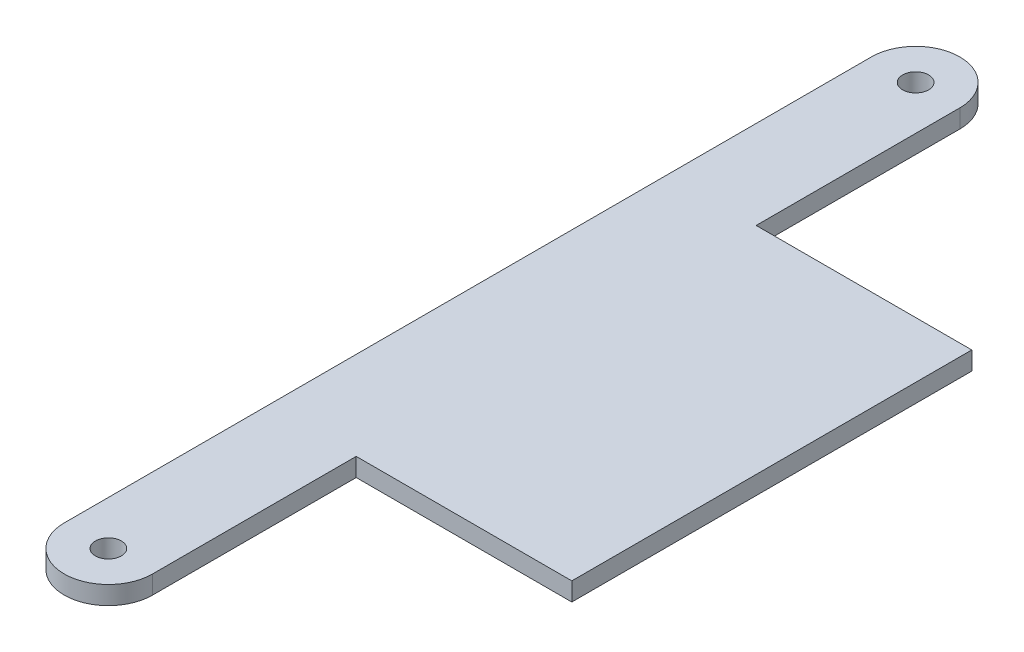
ISO-10303-21;
HEADER;
FILE_DESCRIPTION(('STEP AP214'),'2;1');
FILE_NAME('part.step','',(''),(''),'','','');
FILE_SCHEMA(('AUTOMOTIVE_DESIGN { 1 0 10303 214 1 1 1 1 }'));
ENDSEC;
DATA;
#1=APPLICATION_CONTEXT('core data for automotive mechanical design processes');
#2=APPLICATION_PROTOCOL_DEFINITION('international standard','automotive_design',2000,#1);
#3=PRODUCT_CONTEXT('',#1,'mechanical');
#4=PRODUCT('Part','Part','',(#3));
#5=PRODUCT_RELATED_PRODUCT_CATEGORY('part','',(#4));
#6=PRODUCT_DEFINITION_FORMATION('','',#4);
#7=PRODUCT_DEFINITION_CONTEXT('part definition',#1,'design');
#8=PRODUCT_DEFINITION('design','',#6,#7);
#9=PRODUCT_DEFINITION_SHAPE('','',#8);
#10=(LENGTH_UNIT() NAMED_UNIT(*) SI_UNIT(.MILLI.,.METRE.));
#11=(NAMED_UNIT(*) PLANE_ANGLE_UNIT() SI_UNIT($,.RADIAN.));
#12=(NAMED_UNIT(*) SI_UNIT($,.STERADIAN.) SOLID_ANGLE_UNIT());
#13=UNCERTAINTY_MEASURE_WITH_UNIT(LENGTH_MEASURE(1.E-05),#10,'distance_accuracy_value','');
#14=(GEOMETRIC_REPRESENTATION_CONTEXT(3) GLOBAL_UNCERTAINTY_ASSIGNED_CONTEXT((#13)) GLOBAL_UNIT_ASSIGNED_CONTEXT((#10,
#11,#12)) REPRESENTATION_CONTEXT('',''));
#15=CARTESIAN_POINT('',(0.,0.,0.));
#16=DIRECTION('',(0.,0.,1.));
#17=DIRECTION('',(1.,0.,0.));
#18=AXIS2_PLACEMENT_3D('',#15,#16,#17);
#19=CARTESIAN_POINT('',(-7.64540000000001,194.810979497835,-69.85));
#20=DIRECTION('',(1.,0.,0.));
#21=DIRECTION('',(0.,0.,-1.));
#22=AXIS2_PLACEMENT_3D('',#19,#20,#21);
#23=PLANE('',#22);
#24=DIRECTION('',(0.,0.,1.));
#25=VECTOR('',#24,1.);
#26=CARTESIAN_POINT('',(-7.64540000000001,39.06774,-69.85));
#27=LINE('',#26,#25);
#28=CARTESIAN_POINT('',(-7.64540000000001,39.06774,-69.85));
#29=VERTEX_POINT('',#28);
#30=CARTESIAN_POINT('',(-7.64540000000001,39.06774,69.85));
#31=VERTEX_POINT('',#30);
#32=EDGE_CURVE('E126',#29,#31,#27,.T.);
#33=ORIENTED_EDGE('',*,*,#32,.F.);
#34=DIRECTION('',(0.,-1.,0.));
#35=VECTOR('',#34,1.);
#36=CARTESIAN_POINT('',(-7.64540000000001,194.810979497835,-69.85));
#37=LINE('',#36,#35);
#38=CARTESIAN_POINT('',(-7.64540000000001,35.89274,-69.85));
#39=VERTEX_POINT('',#38);
#40=EDGE_CURVE('E130',#29,#39,#37,.T.);
#41=ORIENTED_EDGE('',*,*,#40,.T.);
#42=DIRECTION('',(0.,0.,1.));
#43=VECTOR('',#42,1.);
#44=CARTESIAN_POINT('',(-7.64540000000001,35.89274,-69.85));
#45=LINE('',#44,#43);
#46=CARTESIAN_POINT('',(-7.64540000000001,35.89274,69.85));
#47=VERTEX_POINT('',#46);
#48=EDGE_CURVE('E133',#39,#47,#45,.T.);
#49=ORIENTED_EDGE('',*,*,#48,.T.);
#50=DIRECTION('',(0.,-1.,0.));
#51=VECTOR('',#50,1.);
#52=CARTESIAN_POINT('',(-7.64540000000001,194.810979497835,69.85));
#53=LINE('',#52,#51);
#54=EDGE_CURVE('E135',#31,#47,#53,.T.);
#55=ORIENTED_EDGE('',*,*,#54,.F.);
#56=EDGE_LOOP('',(#33,#41,#49,#55));
#57=FACE_BOUND('',#56,.T.);
#58=ADVANCED_FACE('F39',(#57),#23,.F.);
#59=CARTESIAN_POINT('',(0.,194.810979497835,-69.85));
#60=DIRECTION('',(0.,-1.,0.));
#61=DIRECTION('',(0.,0.,-1.));
#62=AXIS2_PLACEMENT_3D('',#59,#60,#61);
#63=CYLINDRICAL_SURFACE('',#62,7.64540000000001);
#64=CARTESIAN_POINT('',(0.,39.06774,-69.85));
#65=DIRECTION('',(0.,1.,0.));
#66=DIRECTION('',(0.,0.,1.));
#67=AXIS2_PLACEMENT_3D('',#64,#65,#66);
#68=CIRCLE('',#67,7.64540000000001);
#69=CARTESIAN_POINT('',(7.64540000000001,39.06774,-69.85));
#70=VERTEX_POINT('',#69);
#71=EDGE_CURVE('E124',#70,#29,#68,.T.);
#72=ORIENTED_EDGE('',*,*,#71,.F.);
#73=DIRECTION('',(0.,-1.,0.));
#74=VECTOR('',#73,1.);
#75=CARTESIAN_POINT('',(7.64540000000001,194.810979497835,-69.85));
#76=LINE('',#75,#74);
#77=CARTESIAN_POINT('',(7.64540000000001,35.89274,-69.85));
#78=VERTEX_POINT('',#77);
#79=EDGE_CURVE('E139',#70,#78,#76,.T.);
#80=ORIENTED_EDGE('',*,*,#79,.T.);
#81=CARTESIAN_POINT('',(0.,35.89274,-69.85));
#82=DIRECTION('',(0.,1.,0.));
#83=DIRECTION('',(0.,0.,1.));
#84=AXIS2_PLACEMENT_3D('',#81,#82,#83);
#85=CIRCLE('',#84,7.64540000000001);
#86=EDGE_CURVE('E103',#78,#39,#85,.T.);
#87=ORIENTED_EDGE('',*,*,#86,.T.);
#88=ORIENTED_EDGE('',*,*,#40,.F.);
#89=EDGE_LOOP('',(#72,#80,#87,#88));
#90=FACE_BOUND('',#89,.T.);
#91=ADVANCED_FACE('F218',(#90),#63,.T.);
#92=CARTESIAN_POINT('',(0.,194.810979497835,69.85));
#93=DIRECTION('',(0.,-1.,0.));
#94=DIRECTION('',(0.,0.,-1.));
#95=AXIS2_PLACEMENT_3D('',#92,#93,#94);
#96=CYLINDRICAL_SURFACE('',#95,7.64540000000001);
#97=CARTESIAN_POINT('',(0.,39.06774,69.85));
#98=DIRECTION('',(0.,1.,0.));
#99=DIRECTION('',(0.,0.,1.));
#100=AXIS2_PLACEMENT_3D('',#97,#98,#99);
#101=CIRCLE('',#100,7.64540000000001);
#102=CARTESIAN_POINT('',(7.64540000000001,39.06774,69.85));
#103=VERTEX_POINT('',#102);
#104=EDGE_CURVE('E114',#31,#103,#101,.T.);
#105=ORIENTED_EDGE('',*,*,#104,.F.);
#106=ORIENTED_EDGE('',*,*,#54,.T.);
#107=CARTESIAN_POINT('',(0.,35.89274,69.85));
#108=DIRECTION('',(0.,1.,0.));
#109=DIRECTION('',(0.,0.,1.));
#110=AXIS2_PLACEMENT_3D('',#107,#108,#109);
#111=CIRCLE('',#110,7.64540000000001);
#112=CARTESIAN_POINT('',(7.64540000000001,35.89274,69.85));
#113=VERTEX_POINT('',#112);
#114=EDGE_CURVE('E134',#47,#113,#111,.T.);
#115=ORIENTED_EDGE('',*,*,#114,.T.);
#116=DIRECTION('',(0.,-1.,0.));
#117=VECTOR('',#116,1.);
#118=CARTESIAN_POINT('',(7.64540000000001,194.810979497835,69.85));
#119=LINE('',#118,#117);
#120=EDGE_CURVE('E118',#103,#113,#119,.T.);
#121=ORIENTED_EDGE('',*,*,#120,.F.);
#122=EDGE_LOOP('',(#105,#106,#115,#121));
#123=FACE_BOUND('',#122,.T.);
#124=ADVANCED_FACE('F178',(#123),#96,.T.);
#125=CARTESIAN_POINT('',(0.,39.06774,0.));
#126=DIRECTION('',(0.,1.,0.));
#127=DIRECTION('',(0.,0.,1.));
#128=AXIS2_PLACEMENT_3D('',#125,#126,#127);
#129=PLANE('',#128);
#130=CARTESIAN_POINT('',(0.,39.0677400000001,69.85));
#131=DIRECTION('',(0.,-1.,0.));
#132=DIRECTION('',(0.,0.,-1.));
#133=AXIS2_PLACEMENT_3D('',#130,#131,#132);
#134=CIRCLE('',#133,2.2479);
#135=CARTESIAN_POINT('',(0.,39.0677400000001,67.6021));
#136=VERTEX_POINT('',#135);
#137=EDGE_CURVE('E190',#136,#136,#134,.T.);
#138=ORIENTED_EDGE('',*,*,#137,.T.);
#139=EDGE_LOOP('',(#138));
#140=FACE_BOUND('',#139,.T.);
#141=CARTESIAN_POINT('',(0.,39.0677400000001,-69.85));
#142=DIRECTION('',(0.,-1.,0.));
#143=DIRECTION('',(0.,0.,-1.));
#144=AXIS2_PLACEMENT_3D('',#141,#142,#143);
#145=CIRCLE('',#144,2.2479);
#146=CARTESIAN_POINT('',(0.,39.0677400000001,-72.0979));
#147=VERTEX_POINT('',#146);
#148=EDGE_CURVE('E109',#147,#147,#145,.T.);
#149=ORIENTED_EDGE('',*,*,#148,.T.);
#150=EDGE_LOOP('',(#149));
#151=FACE_BOUND('',#150,.T.);
#152=DIRECTION('',(0.,0.,1.));
#153=VECTOR('',#152,1.);
#154=CARTESIAN_POINT('',(7.64540000000001,39.06774,-69.85));
#155=LINE('',#154,#153);
#156=CARTESIAN_POINT('',(7.64540000000001,39.06774,-34.6075));
#157=VERTEX_POINT('',#156);
#158=EDGE_CURVE('E84',#70,#157,#155,.T.);
#159=ORIENTED_EDGE('',*,*,#158,.F.);
#160=ORIENTED_EDGE('',*,*,#71,.T.);
#161=ORIENTED_EDGE('',*,*,#32,.T.);
#162=ORIENTED_EDGE('',*,*,#104,.T.);
#163=CARTESIAN_POINT('',(7.64540000000001,39.06774,34.6075));
#164=VERTEX_POINT('',#163);
#165=EDGE_CURVE('E99',#164,#103,#155,.T.);
#166=ORIENTED_EDGE('',*,*,#165,.F.);
#167=DIRECTION('',(1.,0.,0.));
#168=VECTOR('',#167,1.);
#169=CARTESIAN_POINT('',(7.64540000000002,39.06774,34.6075));
#170=LINE('',#169,#168);
#171=CARTESIAN_POINT('',(44.958,39.06774,34.6075));
#172=VERTEX_POINT('',#171);
#173=EDGE_CURVE('E106',#164,#172,#170,.T.);
#174=ORIENTED_EDGE('',*,*,#173,.T.);
#175=DIRECTION('',(0.,0.,1.));
#176=VECTOR('',#175,1.);
#177=CARTESIAN_POINT('',(44.958,39.06774,-34.6075));
#178=LINE('',#177,#176);
#179=CARTESIAN_POINT('',(44.958,39.06774,-34.6075));
#180=VERTEX_POINT('',#179);
#181=EDGE_CURVE('E151',#180,#172,#178,.T.);
#182=ORIENTED_EDGE('',*,*,#181,.F.);
#183=DIRECTION('',(1.,0.,0.));
#184=VECTOR('',#183,1.);
#185=CARTESIAN_POINT('',(7.64540000000002,39.06774,-34.6075));
#186=LINE('',#185,#184);
#187=EDGE_CURVE('E147',#157,#180,#186,.T.);
#188=ORIENTED_EDGE('',*,*,#187,.F.);
#189=EDGE_LOOP('',(#159,#160,#161,#162,#166,#174,#182,#188));
#190=FACE_BOUND('',#189,.T.);
#191=ADVANCED_FACE('F111',(#140,#151,#190),#129,.T.);
#192=CARTESIAN_POINT('',(0.,35.89274,-69.85));
#193=DIRECTION('',(0.,1.,0.));
#194=DIRECTION('',(0.,0.,1.));
#195=AXIS2_PLACEMENT_3D('',#192,#193,#194);
#196=PLANE('',#195);
#197=CARTESIAN_POINT('',(0.,35.89274,69.85));
#198=DIRECTION('',(0.,-1.,0.));
#199=DIRECTION('',(0.,0.,-1.));
#200=AXIS2_PLACEMENT_3D('',#197,#198,#199);
#201=CIRCLE('',#200,2.2479);
#202=CARTESIAN_POINT('',(0.,35.89274,67.6021));
#203=VERTEX_POINT('',#202);
#204=EDGE_CURVE('E193',#203,#203,#201,.T.);
#205=ORIENTED_EDGE('',*,*,#204,.F.);
#206=EDGE_LOOP('',(#205));
#207=FACE_BOUND('',#206,.T.);
#208=CARTESIAN_POINT('',(0.,35.89274,-69.85));
#209=DIRECTION('',(0.,-1.,0.));
#210=DIRECTION('',(0.,0.,-1.));
#211=AXIS2_PLACEMENT_3D('',#208,#209,#210);
#212=CIRCLE('',#211,2.2479);
#213=CARTESIAN_POINT('',(0.,35.89274,-72.0979));
#214=VERTEX_POINT('',#213);
#215=EDGE_CURVE('E187',#214,#214,#212,.T.);
#216=ORIENTED_EDGE('',*,*,#215,.F.);
#217=EDGE_LOOP('',(#216));
#218=FACE_BOUND('',#217,.T.);
#219=ORIENTED_EDGE('',*,*,#86,.F.);
#220=DIRECTION('',(0.,0.,1.));
#221=VECTOR('',#220,1.);
#222=CARTESIAN_POINT('',(7.64540000000001,35.89274,-69.85));
#223=LINE('',#222,#221);
#224=CARTESIAN_POINT('',(7.64540000000001,35.89274,-34.6075));
#225=VERTEX_POINT('',#224);
#226=EDGE_CURVE('E116',#78,#225,#223,.T.);
#227=ORIENTED_EDGE('',*,*,#226,.T.);
#228=DIRECTION('',(1.,0.,0.));
#229=VECTOR('',#228,1.);
#230=CARTESIAN_POINT('',(7.64540000000002,35.89274,-34.6075));
#231=LINE('',#230,#229);
#232=CARTESIAN_POINT('',(44.958,35.89274,-34.6075));
#233=VERTEX_POINT('',#232);
#234=EDGE_CURVE('E108',#225,#233,#231,.T.);
#235=ORIENTED_EDGE('',*,*,#234,.T.);
#236=DIRECTION('',(0.,0.,1.));
#237=VECTOR('',#236,1.);
#238=CARTESIAN_POINT('',(44.958,35.89274,-34.6075));
#239=LINE('',#238,#237);
#240=CARTESIAN_POINT('',(44.958,35.89274,34.6075));
#241=VERTEX_POINT('',#240);
#242=EDGE_CURVE('E144',#233,#241,#239,.T.);
#243=ORIENTED_EDGE('',*,*,#242,.T.);
#244=DIRECTION('',(1.,0.,0.));
#245=VECTOR('',#244,1.);
#246=CARTESIAN_POINT('',(7.64540000000002,35.89274,34.6075));
#247=LINE('',#246,#245);
#248=CARTESIAN_POINT('',(7.64540000000001,35.89274,34.6075));
#249=VERTEX_POINT('',#248);
#250=EDGE_CURVE('E127',#249,#241,#247,.T.);
#251=ORIENTED_EDGE('',*,*,#250,.F.);
#252=EDGE_CURVE('E102',#249,#113,#223,.T.);
#253=ORIENTED_EDGE('',*,*,#252,.T.);
#254=ORIENTED_EDGE('',*,*,#114,.F.);
#255=ORIENTED_EDGE('',*,*,#48,.F.);
#256=EDGE_LOOP('',(#219,#227,#235,#243,#251,#253,#254,#255));
#257=FACE_BOUND('',#256,.T.);
#258=ADVANCED_FACE('F158',(#207,#218,#257),#196,.F.);
#259=CARTESIAN_POINT('',(7.64540000000001,194.810979497835,-69.85));
#260=DIRECTION('',(1.,0.,0.));
#261=DIRECTION('',(0.,0.,-1.));
#262=AXIS2_PLACEMENT_3D('',#259,#260,#261);
#263=PLANE('',#262);
#264=ORIENTED_EDGE('',*,*,#252,.F.);
#265=DIRECTION('',(0.,1.,0.));
#266=VECTOR('',#265,1.);
#267=CARTESIAN_POINT('',(7.64540000000001,194.810979497835,34.6075));
#268=LINE('',#267,#266);
#269=EDGE_CURVE('E49',#249,#164,#268,.T.);
#270=ORIENTED_EDGE('',*,*,#269,.T.);
#271=ORIENTED_EDGE('',*,*,#165,.T.);
#272=ORIENTED_EDGE('',*,*,#120,.T.);
#273=EDGE_LOOP('',(#264,#270,#271,#272));
#274=FACE_BOUND('',#273,.T.);
#275=ADVANCED_FACE('F95',(#274),#263,.T.);
#276=DIRECTION('',(0.,1.,0.));
#277=VECTOR('',#276,1.);
#278=CARTESIAN_POINT('',(7.64540000000001,194.810979497835,-34.6075));
#279=LINE('',#278,#277);
#280=EDGE_CURVE('E11',#225,#157,#279,.T.);
#281=ORIENTED_EDGE('',*,*,#280,.F.);
#282=ORIENTED_EDGE('',*,*,#226,.F.);
#283=ORIENTED_EDGE('',*,*,#79,.F.);
#284=ORIENTED_EDGE('',*,*,#158,.T.);
#285=EDGE_LOOP('',(#281,#282,#283,#284));
#286=FACE_BOUND('',#285,.T.);
#287=ADVANCED_FACE('F164',(#286),#263,.T.);
#288=CARTESIAN_POINT('',(44.958,194.810979497835,-34.6075));
#289=DIRECTION('',(1.,0.,0.));
#290=DIRECTION('',(0.,0.,-1.));
#291=AXIS2_PLACEMENT_3D('',#288,#289,#290);
#292=PLANE('',#291);
#293=DIRECTION('',(0.,-1.,0.));
#294=VECTOR('',#293,1.);
#295=CARTESIAN_POINT('',(44.958,194.810979497835,-34.6075));
#296=LINE('',#295,#294);
#297=EDGE_CURVE('E43',#180,#233,#296,.T.);
#298=ORIENTED_EDGE('',*,*,#297,.F.);
#299=ORIENTED_EDGE('',*,*,#181,.T.);
#300=DIRECTION('',(0.,-1.,0.));
#301=VECTOR('',#300,1.);
#302=CARTESIAN_POINT('',(44.958,194.810979497835,34.6075));
#303=LINE('',#302,#301);
#304=EDGE_CURVE('E76',#172,#241,#303,.T.);
#305=ORIENTED_EDGE('',*,*,#304,.T.);
#306=ORIENTED_EDGE('',*,*,#242,.F.);
#307=EDGE_LOOP('',(#298,#299,#305,#306));
#308=FACE_BOUND('',#307,.T.);
#309=ADVANCED_FACE('F155',(#308),#292,.T.);
#310=CARTESIAN_POINT('',(7.64540000000002,194.810979497835,34.6075));
#311=DIRECTION('',(0.,0.,-1.));
#312=DIRECTION('',(-1.,0.,0.));
#313=AXIS2_PLACEMENT_3D('',#310,#311,#312);
#314=PLANE('',#313);
#315=ORIENTED_EDGE('',*,*,#173,.F.);
#316=ORIENTED_EDGE('',*,*,#269,.F.);
#317=ORIENTED_EDGE('',*,*,#250,.T.);
#318=ORIENTED_EDGE('',*,*,#304,.F.);
#319=EDGE_LOOP('',(#315,#316,#317,#318));
#320=FACE_BOUND('',#319,.T.);
#321=ADVANCED_FACE('F107',(#320),#314,.F.);
#322=CARTESIAN_POINT('',(7.64540000000002,194.810979497835,-34.6075));
#323=DIRECTION('',(0.,0.,-1.));
#324=DIRECTION('',(-1.,0.,0.));
#325=AXIS2_PLACEMENT_3D('',#322,#323,#324);
#326=PLANE('',#325);
#327=ORIENTED_EDGE('',*,*,#280,.T.);
#328=ORIENTED_EDGE('',*,*,#187,.T.);
#329=ORIENTED_EDGE('',*,*,#297,.T.);
#330=ORIENTED_EDGE('',*,*,#234,.F.);
#331=EDGE_LOOP('',(#327,#328,#329,#330));
#332=FACE_BOUND('',#331,.T.);
#333=ADVANCED_FACE('F41',(#332),#326,.T.);
#334=CARTESIAN_POINT('',(0.,35.89274,-69.85));
#335=DIRECTION('',(0.,-1.,0.));
#336=DIRECTION('',(0.,0.,-1.));
#337=AXIS2_PLACEMENT_3D('',#334,#335,#336);
#338=CYLINDRICAL_SURFACE('',#337,2.2479);
#339=ORIENTED_EDGE('',*,*,#148,.F.);
#340=EDGE_LOOP('',(#339));
#341=FACE_BOUND('',#340,.T.);
#342=ORIENTED_EDGE('',*,*,#215,.T.);
#343=EDGE_LOOP('',(#342));
#344=FACE_BOUND('',#343,.T.);
#345=ADVANCED_FACE('F204',(#341,#344),#338,.F.);
#346=CARTESIAN_POINT('',(0.,35.89274,69.85));
#347=DIRECTION('',(0.,-1.,0.));
#348=DIRECTION('',(0.,0.,-1.));
#349=AXIS2_PLACEMENT_3D('',#346,#347,#348);
#350=CYLINDRICAL_SURFACE('',#349,2.2479);
#351=ORIENTED_EDGE('',*,*,#137,.F.);
#352=EDGE_LOOP('',(#351));
#353=FACE_BOUND('',#352,.T.);
#354=ORIENTED_EDGE('',*,*,#204,.T.);
#355=EDGE_LOOP('',(#354));
#356=FACE_BOUND('',#355,.T.);
#357=ADVANCED_FACE('F197',(#353,#356),#350,.F.);
#358=CLOSED_SHELL('',(#58,#91,#124,#191,#258,#275,#287,#309,#321,#333,#345,#357));
#359=MANIFOLD_SOLID_BREP('B2',#358);
#360=ADVANCED_BREP_SHAPE_REPRESENTATION('',(#18,#359),#14);
#361=SHAPE_DEFINITION_REPRESENTATION(#9,#360);
ENDSEC;
END-ISO-10303-21;
